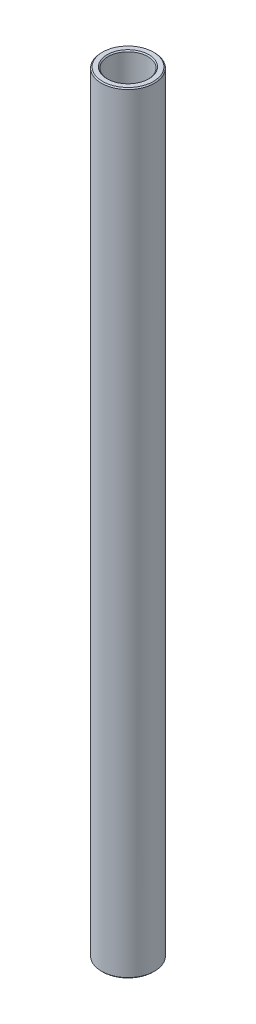
ISO-10303-21;
HEADER;
FILE_DESCRIPTION(('STEP AP214'),'2;1');
FILE_NAME('part.step','',(''),(''),'','','');
FILE_SCHEMA(('AUTOMOTIVE_DESIGN { 1 0 10303 214 1 1 1 1 }'));
ENDSEC;
DATA;
#1=APPLICATION_CONTEXT('core data for automotive mechanical design processes');
#2=APPLICATION_PROTOCOL_DEFINITION('international standard','automotive_design',2000,#1);
#3=PRODUCT_CONTEXT('',#1,'mechanical');
#4=PRODUCT('Part','Part','',(#3));
#5=PRODUCT_RELATED_PRODUCT_CATEGORY('part','',(#4));
#6=PRODUCT_DEFINITION_FORMATION('','',#4);
#7=PRODUCT_DEFINITION_CONTEXT('part definition',#1,'design');
#8=PRODUCT_DEFINITION('design','',#6,#7);
#9=PRODUCT_DEFINITION_SHAPE('','',#8);
#10=(LENGTH_UNIT() NAMED_UNIT(*) SI_UNIT(.MILLI.,.METRE.));
#11=(NAMED_UNIT(*) PLANE_ANGLE_UNIT() SI_UNIT($,.RADIAN.));
#12=(NAMED_UNIT(*) SI_UNIT($,.STERADIAN.) SOLID_ANGLE_UNIT());
#13=UNCERTAINTY_MEASURE_WITH_UNIT(LENGTH_MEASURE(1.E-05),#10,'distance_accuracy_value','');
#14=(GEOMETRIC_REPRESENTATION_CONTEXT(3) GLOBAL_UNCERTAINTY_ASSIGNED_CONTEXT((#13)) GLOBAL_UNIT_ASSIGNED_CONTEXT((#10,
#11,#12)) REPRESENTATION_CONTEXT('',''));
#15=CARTESIAN_POINT('',(0.,0.,0.));
#16=DIRECTION('',(0.,0.,1.));
#17=DIRECTION('',(1.,0.,0.));
#18=AXIS2_PLACEMENT_3D('',#15,#16,#17);
#19=CARTESIAN_POINT('',(0.,11.60859375,0.));
#20=DIRECTION('',(0.,1.,0.));
#21=DIRECTION('',(-1.,0.,0.));
#22=AXIS2_PLACEMENT_3D('',#19,#20,#21);
#23=CYLINDRICAL_SURFACE('',#22,4.76249999999999);
#24=CARTESIAN_POINT('',(0.,-92.217875,0.));
#25=DIRECTION('',(0.,1.,0.));
#26=DIRECTION('',(-1.,0.,0.));
#27=AXIS2_PLACEMENT_3D('',#24,#25,#26);
#28=CIRCLE('',#27,4.76249999999999);
#29=CARTESIAN_POINT('',(-4.7625,-92.217875,0.));
#30=VERTEX_POINT('',#29);
#31=EDGE_CURVE('E50',#30,#30,#28,.F.);
#32=ORIENTED_EDGE('',*,*,#31,.T.);
#33=EDGE_LOOP('',(#32));
#34=FACE_BOUND('',#33,.T.);
#35=CARTESIAN_POINT('',(0.,92.2178750000001,0.));
#36=DIRECTION('',(0.,-1.,0.));
#37=DIRECTION('',(1.,0.,0.));
#38=AXIS2_PLACEMENT_3D('',#35,#36,#37);
#39=CIRCLE('',#38,4.76249999999999);
#40=CARTESIAN_POINT('',(4.76250000000001,92.2178750000001,0.));
#41=VERTEX_POINT('',#40);
#42=EDGE_CURVE('E53',#41,#41,#39,.F.);
#43=ORIENTED_EDGE('',*,*,#42,.T.);
#44=EDGE_LOOP('',(#43));
#45=FACE_BOUND('',#44,.T.);
#46=ADVANCED_FACE('F30',(#34,#45),#23,.F.);
#47=CARTESIAN_POINT('',(4.76249999999998,92.471875,0.));
#48=DIRECTION('',(0.,-1.,0.));
#49=DIRECTION('',(1.,0.,0.));
#50=AXIS2_PLACEMENT_3D('',#47,#48,#49);
#51=PLANE('',#50);
#52=CARTESIAN_POINT('',(0.,92.471875,0.));
#53=DIRECTION('',(0.,-1.,0.));
#54=DIRECTION('',(1.,0.,0.));
#55=AXIS2_PLACEMENT_3D('',#52,#53,#54);
#56=CIRCLE('',#55,6.09599999999999);
#57=CARTESIAN_POINT('',(6.096,92.471875,0.));
#58=VERTEX_POINT('',#57);
#59=EDGE_CURVE('E10',#58,#58,#56,.F.);
#60=ORIENTED_EDGE('',*,*,#59,.T.);
#61=EDGE_LOOP('',(#60));
#62=FACE_BOUND('',#61,.T.);
#63=CARTESIAN_POINT('',(0.,92.471875,0.));
#64=DIRECTION('',(0.,-1.,0.));
#65=DIRECTION('',(1.,0.,0.));
#66=AXIS2_PLACEMENT_3D('',#63,#64,#65);
#67=CIRCLE('',#66,5.0164999999999);
#68=CARTESIAN_POINT('',(5.01649999999991,92.471875,0.));
#69=VERTEX_POINT('',#68);
#70=EDGE_CURVE('E37',#69,#69,#67,.T.);
#71=ORIENTED_EDGE('',*,*,#70,.T.);
#72=EDGE_LOOP('',(#71));
#73=FACE_BOUND('',#72,.T.);
#74=ADVANCED_FACE('F76',(#62,#73),#51,.F.);
#75=CARTESIAN_POINT('',(0.,11.60859375,0.));
#76=DIRECTION('',(0.,1.,0.));
#77=DIRECTION('',(-1.,0.,0.));
#78=AXIS2_PLACEMENT_3D('',#75,#76,#77);
#79=CYLINDRICAL_SURFACE('',#78,6.35);
#80=CARTESIAN_POINT('',(0.,-92.2178750000001,0.));
#81=DIRECTION('',(0.,1.,0.));
#82=DIRECTION('',(-1.,0.,0.));
#83=AXIS2_PLACEMENT_3D('',#80,#81,#82);
#84=CIRCLE('',#83,6.35);
#85=CARTESIAN_POINT('',(-6.35000000000001,-92.2178750000001,0.));
#86=VERTEX_POINT('',#85);
#87=EDGE_CURVE('E41',#86,#86,#84,.T.);
#88=ORIENTED_EDGE('',*,*,#87,.T.);
#89=EDGE_LOOP('',(#88));
#90=FACE_BOUND('',#89,.T.);
#91=CARTESIAN_POINT('',(0.,92.217875,0.));
#92=DIRECTION('',(0.,-1.,0.));
#93=DIRECTION('',(1.,0.,0.));
#94=AXIS2_PLACEMENT_3D('',#91,#92,#93);
#95=CIRCLE('',#94,6.35);
#96=CARTESIAN_POINT('',(6.35000000000001,92.217875,0.));
#97=VERTEX_POINT('',#96);
#98=EDGE_CURVE('E45',#97,#97,#95,.T.);
#99=ORIENTED_EDGE('',*,*,#98,.T.);
#100=EDGE_LOOP('',(#99));
#101=FACE_BOUND('',#100,.T.);
#102=ADVANCED_FACE('F73',(#90,#101),#79,.T.);
#103=CARTESIAN_POINT('',(6.35000000000001,-92.471875,0.));
#104=DIRECTION('',(0.,1.,0.));
#105=DIRECTION('',(-1.,0.,0.));
#106=AXIS2_PLACEMENT_3D('',#103,#104,#105);
#107=PLANE('',#106);
#108=CARTESIAN_POINT('',(0.,-92.471875,0.));
#109=DIRECTION('',(0.,1.,0.));
#110=DIRECTION('',(-1.,0.,0.));
#111=AXIS2_PLACEMENT_3D('',#108,#109,#110);
#112=CIRCLE('',#111,5.01650000000003);
#113=CARTESIAN_POINT('',(-5.01650000000004,-92.471875,0.));
#114=VERTEX_POINT('',#113);
#115=EDGE_CURVE('E56',#114,#114,#112,.T.);
#116=ORIENTED_EDGE('',*,*,#115,.T.);
#117=EDGE_LOOP('',(#116));
#118=FACE_BOUND('',#117,.T.);
#119=CARTESIAN_POINT('',(0.,-92.471875,0.));
#120=DIRECTION('',(0.,1.,0.));
#121=DIRECTION('',(-1.,0.,0.));
#122=AXIS2_PLACEMENT_3D('',#119,#120,#121);
#123=CIRCLE('',#122,6.0960000000001);
#124=CARTESIAN_POINT('',(-6.09600000000011,-92.471875,0.));
#125=VERTEX_POINT('',#124);
#126=EDGE_CURVE('E59',#125,#125,#123,.F.);
#127=ORIENTED_EDGE('',*,*,#126,.T.);
#128=EDGE_LOOP('',(#127));
#129=FACE_BOUND('',#128,.T.);
#130=ADVANCED_FACE('F63',(#118,#129),#107,.F.);
#131=CARTESIAN_POINT('',(0.,-92.471875,0.));
#132=DIRECTION('',(0.,-1.,0.));
#133=DIRECTION('',(1.,0.,0.));
#134=AXIS2_PLACEMENT_3D('',#131,#132,#133);
#135=CONICAL_SURFACE('',#134,5.01650000000003,0.785398163397491);
#136=ORIENTED_EDGE('',*,*,#31,.F.);
#137=EDGE_LOOP('',(#136));
#138=FACE_BOUND('',#137,.T.);
#139=ORIENTED_EDGE('',*,*,#115,.F.);
#140=EDGE_LOOP('',(#139));
#141=FACE_BOUND('',#140,.T.);
#142=ADVANCED_FACE('F69',(#138,#141),#135,.F.);
#143=CARTESIAN_POINT('',(0.,-92.2178750000001,0.));
#144=DIRECTION('',(0.,1.,0.));
#145=DIRECTION('',(-1.,0.,0.));
#146=AXIS2_PLACEMENT_3D('',#143,#144,#145);
#147=CONICAL_SURFACE('',#146,6.35,0.78539816339746);
#148=ORIENTED_EDGE('',*,*,#126,.F.);
#149=EDGE_LOOP('',(#148));
#150=FACE_BOUND('',#149,.T.);
#151=ORIENTED_EDGE('',*,*,#87,.F.);
#152=EDGE_LOOP('',(#151));
#153=FACE_BOUND('',#152,.T.);
#154=ADVANCED_FACE('F65',(#150,#153),#147,.T.);
#155=CARTESIAN_POINT('',(0.,92.471875,0.));
#156=DIRECTION('',(0.,-1.,0.));
#157=DIRECTION('',(1.,0.,0.));
#158=AXIS2_PLACEMENT_3D('',#155,#156,#157);
#159=CONICAL_SURFACE('',#158,6.09599999999999,0.78539816339746);
#160=ORIENTED_EDGE('',*,*,#98,.F.);
#161=EDGE_LOOP('',(#160));
#162=FACE_BOUND('',#161,.T.);
#163=ORIENTED_EDGE('',*,*,#59,.F.);
#164=EDGE_LOOP('',(#163));
#165=FACE_BOUND('',#164,.T.);
#166=ADVANCED_FACE('F68',(#162,#165),#159,.T.);
#167=CARTESIAN_POINT('',(0.,92.2178750000001,0.));
#168=DIRECTION('',(0.,1.,0.));
#169=DIRECTION('',(-1.,0.,0.));
#170=AXIS2_PLACEMENT_3D('',#167,#168,#169);
#171=CONICAL_SURFACE('',#170,4.76249999999999,0.785398163397436);
#172=ORIENTED_EDGE('',*,*,#70,.F.);
#173=EDGE_LOOP('',(#172));
#174=FACE_BOUND('',#173,.T.);
#175=ORIENTED_EDGE('',*,*,#42,.F.);
#176=EDGE_LOOP('',(#175));
#177=FACE_BOUND('',#176,.T.);
#178=ADVANCED_FACE('F32',(#174,#177),#171,.F.);
#179=CLOSED_SHELL('',(#46,#74,#102,#130,#142,#154,#166,#178));
#180=MANIFOLD_SOLID_BREP('B2',#179);
#181=ADVANCED_BREP_SHAPE_REPRESENTATION('',(#18,#180),#14);
#182=SHAPE_DEFINITION_REPRESENTATION(#9,#181);
ENDSEC;
END-ISO-10303-21;
